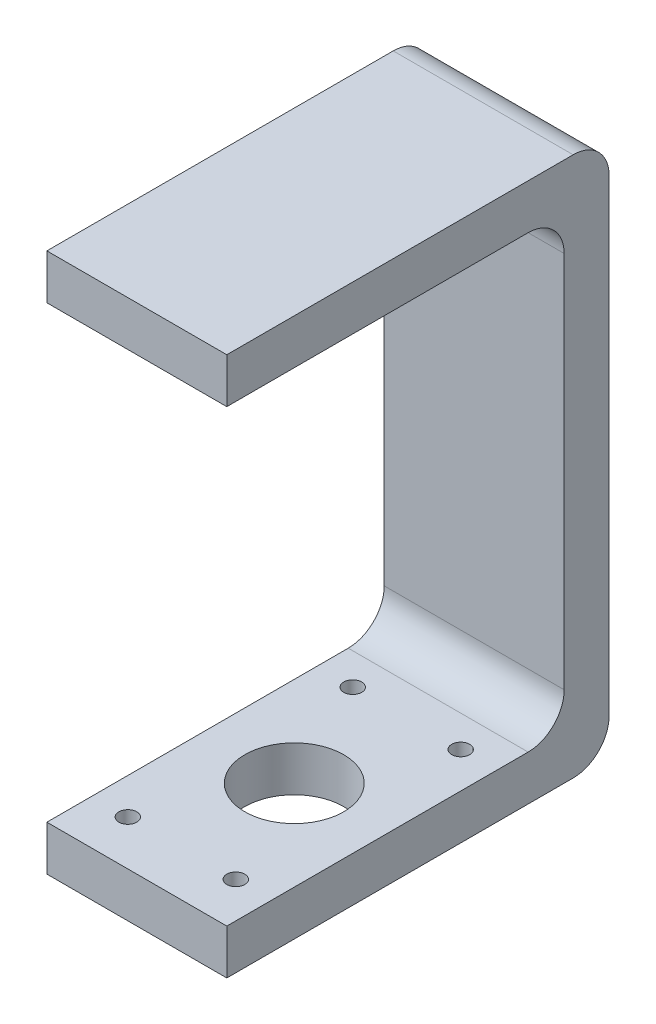
ISO-10303-21;
HEADER;
FILE_DESCRIPTION(('STEP AP214'),'2;1');
FILE_NAME('part.step','',(''),(''),'','','');
FILE_SCHEMA(('AUTOMOTIVE_DESIGN { 1 0 10303 214 1 1 1 1 }'));
ENDSEC;
DATA;
#1=APPLICATION_CONTEXT('core data for automotive mechanical design processes');
#2=APPLICATION_PROTOCOL_DEFINITION('international standard','automotive_design',2000,#1);
#3=PRODUCT_CONTEXT('',#1,'mechanical');
#4=PRODUCT('Part','Part','',(#3));
#5=PRODUCT_RELATED_PRODUCT_CATEGORY('part','',(#4));
#6=PRODUCT_DEFINITION_FORMATION('','',#4);
#7=PRODUCT_DEFINITION_CONTEXT('part definition',#1,'design');
#8=PRODUCT_DEFINITION('design','',#6,#7);
#9=PRODUCT_DEFINITION_SHAPE('','',#8);
#10=(LENGTH_UNIT() NAMED_UNIT(*) SI_UNIT(.MILLI.,.METRE.));
#11=(NAMED_UNIT(*) PLANE_ANGLE_UNIT() SI_UNIT($,.RADIAN.));
#12=(NAMED_UNIT(*) SI_UNIT($,.STERADIAN.) SOLID_ANGLE_UNIT());
#13=UNCERTAINTY_MEASURE_WITH_UNIT(LENGTH_MEASURE(1.E-05),#10,'distance_accuracy_value','');
#14=(GEOMETRIC_REPRESENTATION_CONTEXT(3) GLOBAL_UNCERTAINTY_ASSIGNED_CONTEXT((#13)) GLOBAL_UNIT_ASSIGNED_CONTEXT((#10,
#11,#12)) REPRESENTATION_CONTEXT('',''));
#15=CARTESIAN_POINT('',(0.,0.,0.));
#16=DIRECTION('',(0.,0.,1.));
#17=DIRECTION('',(1.,0.,0.));
#18=AXIS2_PLACEMENT_3D('',#15,#16,#17);
#19=CARTESIAN_POINT('',(40.,10.,0.));
#20=DIRECTION('',(0.,0.,-1.));
#21=DIRECTION('',(0.,1.,0.));
#22=AXIS2_PLACEMENT_3D('',#19,#20,#21);
#23=PLANE('',#22);
#24=DIRECTION('',(0.,-1.,0.));
#25=VECTOR('',#24,1.);
#26=CARTESIAN_POINT('',(0.,10.,0.));
#27=LINE('',#26,#25);
#28=CARTESIAN_POINT('',(0.,10.,0.));
#29=VERTEX_POINT('',#28);
#30=CARTESIAN_POINT('',(0.,0.,0.));
#31=VERTEX_POINT('',#30);
#32=EDGE_CURVE('E157',#29,#31,#27,.T.);
#33=ORIENTED_EDGE('',*,*,#32,.T.);
#34=DIRECTION('',(-1.,0.,0.));
#35=VECTOR('',#34,1.);
#36=CARTESIAN_POINT('',(40.,0.,0.));
#37=LINE('',#36,#35);
#38=CARTESIAN_POINT('',(40.,0.,0.));
#39=VERTEX_POINT('',#38);
#40=EDGE_CURVE('E11',#39,#31,#37,.T.);
#41=ORIENTED_EDGE('',*,*,#40,.F.);
#42=DIRECTION('',(0.,-1.,0.));
#43=VECTOR('',#42,1.);
#44=CARTESIAN_POINT('',(40.,10.,0.));
#45=LINE('',#44,#43);
#46=CARTESIAN_POINT('',(40.,10.,0.));
#47=VERTEX_POINT('',#46);
#48=EDGE_CURVE('E180',#47,#39,#45,.T.);
#49=ORIENTED_EDGE('',*,*,#48,.F.);
#50=DIRECTION('',(-1.,0.,0.));
#51=VECTOR('',#50,1.);
#52=CARTESIAN_POINT('',(40.,10.,0.));
#53=LINE('',#52,#51);
#54=EDGE_CURVE('E153',#47,#29,#53,.T.);
#55=ORIENTED_EDGE('',*,*,#54,.T.);
#56=EDGE_LOOP('',(#33,#41,#49,#55));
#57=FACE_BOUND('',#56,.T.);
#58=ADVANCED_FACE('F35',(#57),#23,.F.);
#59=CARTESIAN_POINT('',(40.,0.,0.));
#60=DIRECTION('',(0.,1.,0.));
#61=DIRECTION('',(0.,0.,1.));
#62=AXIS2_PLACEMENT_3D('',#59,#60,#61);
#63=PLANE('',#62);
#64=CARTESIAN_POINT('',(31.9999999999999,0.,-10.0000000000004));
#65=DIRECTION('',(0.,-1.,0.));
#66=DIRECTION('',(0.,0.,-1.));
#67=AXIS2_PLACEMENT_3D('',#64,#65,#66);
#68=CIRCLE('',#67,2.);
#69=CARTESIAN_POINT('',(31.9999999999999,0.,-12.0000000000003));
#70=VERTEX_POINT('',#69);
#71=EDGE_CURVE('E212',#70,#70,#68,.T.);
#72=ORIENTED_EDGE('',*,*,#71,.F.);
#73=EDGE_LOOP('',(#72));
#74=FACE_BOUND('',#73,.T.);
#75=CARTESIAN_POINT('',(7.99999999999992,0.,-60.0000000000004));
#76=DIRECTION('',(0.,-1.,0.));
#77=DIRECTION('',(0.,0.,-1.));
#78=AXIS2_PLACEMENT_3D('',#75,#76,#77);
#79=CIRCLE('',#78,2.);
#80=CARTESIAN_POINT('',(7.99999999999992,0.,-62.0000000000004));
#81=VERTEX_POINT('',#80);
#82=EDGE_CURVE('E385',#81,#81,#79,.T.);
#83=ORIENTED_EDGE('',*,*,#82,.F.);
#84=EDGE_LOOP('',(#83));
#85=FACE_BOUND('',#84,.T.);
#86=CARTESIAN_POINT('',(31.9999999999999,0.,-60.0000000000004));
#87=DIRECTION('',(0.,-1.,0.));
#88=DIRECTION('',(0.,0.,-1.));
#89=AXIS2_PLACEMENT_3D('',#86,#87,#88);
#90=CIRCLE('',#89,2.);
#91=CARTESIAN_POINT('',(31.9999999999999,0.,-62.0000000000004));
#92=VERTEX_POINT('',#91);
#93=EDGE_CURVE('E225',#92,#92,#90,.T.);
#94=ORIENTED_EDGE('',*,*,#93,.F.);
#95=EDGE_LOOP('',(#94));
#96=FACE_BOUND('',#95,.T.);
#97=CARTESIAN_POINT('',(7.99999999999992,0.,-10.0000000000004));
#98=DIRECTION('',(0.,-1.,0.));
#99=DIRECTION('',(0.,0.,-1.));
#100=AXIS2_PLACEMENT_3D('',#97,#98,#99);
#101=CIRCLE('',#100,2.);
#102=CARTESIAN_POINT('',(7.99999999999992,0.,-12.0000000000004));
#103=VERTEX_POINT('',#102);
#104=EDGE_CURVE('E208',#103,#103,#101,.T.);
#105=ORIENTED_EDGE('',*,*,#104,.F.);
#106=EDGE_LOOP('',(#105));
#107=FACE_BOUND('',#106,.T.);
#108=CARTESIAN_POINT('',(20.,0.,-35.));
#109=DIRECTION('',(0.,-1.,0.));
#110=DIRECTION('',(0.,0.,-1.));
#111=AXIS2_PLACEMENT_3D('',#108,#109,#110);
#112=CIRCLE('',#111,11.);
#113=CARTESIAN_POINT('',(20.,0.,-46.));
#114=VERTEX_POINT('',#113);
#115=EDGE_CURVE('E161',#114,#114,#112,.T.);
#116=ORIENTED_EDGE('',*,*,#115,.F.);
#117=EDGE_LOOP('',(#116));
#118=FACE_BOUND('',#117,.T.);
#119=DIRECTION('',(0.,0.,-1.));
#120=VECTOR('',#119,1.);
#121=CARTESIAN_POINT('',(0.,0.,0.));
#122=LINE('',#121,#120);
#123=CARTESIAN_POINT('',(0.,0.,-77.));
#124=VERTEX_POINT('',#123);
#125=EDGE_CURVE('E160',#31,#124,#122,.T.);
#126=ORIENTED_EDGE('',*,*,#125,.T.);
#127=DIRECTION('',(-1.,0.,0.));
#128=VECTOR('',#127,1.);
#129=CARTESIAN_POINT('',(40.,0.,-77.));
#130=LINE('',#129,#128);
#131=CARTESIAN_POINT('',(40.,0.,-77.));
#132=VERTEX_POINT('',#131);
#133=EDGE_CURVE('E44',#132,#124,#130,.T.);
#134=ORIENTED_EDGE('',*,*,#133,.F.);
#135=DIRECTION('',(0.,0.,-1.));
#136=VECTOR('',#135,1.);
#137=CARTESIAN_POINT('',(40.,0.,0.));
#138=LINE('',#137,#136);
#139=EDGE_CURVE('E108',#39,#132,#138,.T.);
#140=ORIENTED_EDGE('',*,*,#139,.F.);
#141=ORIENTED_EDGE('',*,*,#40,.T.);
#142=EDGE_LOOP('',(#126,#134,#140,#141));
#143=FACE_BOUND('',#142,.T.);
#144=ADVANCED_FACE('F274',(#74,#85,#96,#107,#118,#143),#63,.F.);
#145=CARTESIAN_POINT('',(40.,8.,-77.));
#146=DIRECTION('',(-1.,0.,0.));
#147=DIRECTION('',(0.,0.,1.));
#148=AXIS2_PLACEMENT_3D('',#145,#146,#147);
#149=CYLINDRICAL_SURFACE('',#148,8.);
#150=CARTESIAN_POINT('',(0.,8.,-77.));
#151=DIRECTION('',(1.,0.,0.));
#152=DIRECTION('',(0.,0.,1.));
#153=AXIS2_PLACEMENT_3D('',#150,#151,#152);
#154=CIRCLE('',#153,8.);
#155=CARTESIAN_POINT('',(0.,8.,-85.));
#156=VERTEX_POINT('',#155);
#157=EDGE_CURVE('E163',#124,#156,#154,.T.);
#158=ORIENTED_EDGE('',*,*,#157,.T.);
#159=DIRECTION('',(-1.,0.,0.));
#160=VECTOR('',#159,1.);
#161=CARTESIAN_POINT('',(40.,8.,-85.));
#162=LINE('',#161,#160);
#163=CARTESIAN_POINT('',(40.,8.,-85.));
#164=VERTEX_POINT('',#163);
#165=EDGE_CURVE('E199',#164,#156,#162,.T.);
#166=ORIENTED_EDGE('',*,*,#165,.F.);
#167=CARTESIAN_POINT('',(40.,8.,-77.));
#168=DIRECTION('',(1.,0.,0.));
#169=DIRECTION('',(0.,0.,1.));
#170=AXIS2_PLACEMENT_3D('',#167,#168,#169);
#171=CIRCLE('',#170,8.);
#172=EDGE_CURVE('E233',#132,#164,#171,.T.);
#173=ORIENTED_EDGE('',*,*,#172,.F.);
#174=ORIENTED_EDGE('',*,*,#133,.T.);
#175=EDGE_LOOP('',(#158,#166,#173,#174));
#176=FACE_BOUND('',#175,.T.);
#177=ADVANCED_FACE('F278',(#176),#149,.T.);
#178=CARTESIAN_POINT('',(40.,8.,-85.));
#179=DIRECTION('',(0.,0.,1.));
#180=DIRECTION('',(1.,0.,0.));
#181=AXIS2_PLACEMENT_3D('',#178,#179,#180);
#182=PLANE('',#181);
#183=DIRECTION('',(0.,1.,0.));
#184=VECTOR('',#183,1.);
#185=CARTESIAN_POINT('',(0.,8.,-85.));
#186=LINE('',#185,#184);
#187=CARTESIAN_POINT('',(0.,112.,-85.));
#188=VERTEX_POINT('',#187);
#189=EDGE_CURVE('E165',#156,#188,#186,.T.);
#190=ORIENTED_EDGE('',*,*,#189,.T.);
#191=DIRECTION('',(-1.,0.,0.));
#192=VECTOR('',#191,1.);
#193=CARTESIAN_POINT('',(40.,112.,-85.));
#194=LINE('',#193,#192);
#195=CARTESIAN_POINT('',(40.,112.,-85.));
#196=VERTEX_POINT('',#195);
#197=EDGE_CURVE('E196',#196,#188,#194,.T.);
#198=ORIENTED_EDGE('',*,*,#197,.F.);
#199=DIRECTION('',(0.,1.,0.));
#200=VECTOR('',#199,1.);
#201=CARTESIAN_POINT('',(40.,8.,-85.));
#202=LINE('',#201,#200);
#203=EDGE_CURVE('E235',#164,#196,#202,.T.);
#204=ORIENTED_EDGE('',*,*,#203,.F.);
#205=ORIENTED_EDGE('',*,*,#165,.T.);
#206=EDGE_LOOP('',(#190,#198,#204,#205));
#207=FACE_BOUND('',#206,.T.);
#208=ADVANCED_FACE('F283',(#207),#182,.F.);
#209=CARTESIAN_POINT('',(40.,112.,-77.));
#210=DIRECTION('',(-1.,0.,0.));
#211=DIRECTION('',(0.,0.,1.));
#212=AXIS2_PLACEMENT_3D('',#209,#210,#211);
#213=CYLINDRICAL_SURFACE('',#212,8.);
#214=CARTESIAN_POINT('',(0.,112.,-77.));
#215=DIRECTION('',(1.,0.,0.));
#216=DIRECTION('',(0.,0.,-1.));
#217=AXIS2_PLACEMENT_3D('',#214,#215,#216);
#218=CIRCLE('',#217,8.);
#219=CARTESIAN_POINT('',(0.,120.,-77.));
#220=VERTEX_POINT('',#219);
#221=EDGE_CURVE('E167',#188,#220,#218,.T.);
#222=ORIENTED_EDGE('',*,*,#221,.T.);
#223=DIRECTION('',(-1.,0.,0.));
#224=VECTOR('',#223,1.);
#225=CARTESIAN_POINT('',(40.,120.,-77.));
#226=LINE('',#225,#224);
#227=CARTESIAN_POINT('',(40.,120.,-77.));
#228=VERTEX_POINT('',#227);
#229=EDGE_CURVE('E193',#228,#220,#226,.T.);
#230=ORIENTED_EDGE('',*,*,#229,.F.);
#231=CARTESIAN_POINT('',(40.,112.,-77.));
#232=DIRECTION('',(1.,0.,0.));
#233=DIRECTION('',(0.,0.,-1.));
#234=AXIS2_PLACEMENT_3D('',#231,#232,#233);
#235=CIRCLE('',#234,8.);
#236=EDGE_CURVE('E237',#196,#228,#235,.T.);
#237=ORIENTED_EDGE('',*,*,#236,.F.);
#238=ORIENTED_EDGE('',*,*,#197,.T.);
#239=EDGE_LOOP('',(#222,#230,#237,#238));
#240=FACE_BOUND('',#239,.T.);
#241=ADVANCED_FACE('F291',(#240),#213,.T.);
#242=CARTESIAN_POINT('',(40.,120.,-77.));
#243=DIRECTION('',(0.,-1.,0.));
#244=DIRECTION('',(0.,0.,-1.));
#245=AXIS2_PLACEMENT_3D('',#242,#243,#244);
#246=PLANE('',#245);
#247=DIRECTION('',(0.,0.,1.));
#248=VECTOR('',#247,1.);
#249=CARTESIAN_POINT('',(0.,120.,-77.));
#250=LINE('',#249,#248);
#251=CARTESIAN_POINT('',(0.,120.,0.));
#252=VERTEX_POINT('',#251);
#253=EDGE_CURVE('E169',#220,#252,#250,.T.);
#254=ORIENTED_EDGE('',*,*,#253,.T.);
#255=DIRECTION('',(-1.,0.,0.));
#256=VECTOR('',#255,1.);
#257=CARTESIAN_POINT('',(40.,120.,0.));
#258=LINE('',#257,#256);
#259=CARTESIAN_POINT('',(40.,120.,0.));
#260=VERTEX_POINT('',#259);
#261=EDGE_CURVE('E190',#260,#252,#258,.T.);
#262=ORIENTED_EDGE('',*,*,#261,.F.);
#263=DIRECTION('',(0.,0.,1.));
#264=VECTOR('',#263,1.);
#265=CARTESIAN_POINT('',(40.,120.,-77.));
#266=LINE('',#265,#264);
#267=EDGE_CURVE('E239',#228,#260,#266,.T.);
#268=ORIENTED_EDGE('',*,*,#267,.F.);
#269=ORIENTED_EDGE('',*,*,#229,.T.);
#270=EDGE_LOOP('',(#254,#262,#268,#269));
#271=FACE_BOUND('',#270,.T.);
#272=ADVANCED_FACE('F295',(#271),#246,.F.);
#273=CARTESIAN_POINT('',(40.,120.,0.));
#274=DIRECTION('',(0.,0.,-1.));
#275=DIRECTION('',(0.,1.,0.));
#276=AXIS2_PLACEMENT_3D('',#273,#274,#275);
#277=PLANE('',#276);
#278=DIRECTION('',(0.,-1.,0.));
#279=VECTOR('',#278,1.);
#280=CARTESIAN_POINT('',(0.,120.,0.));
#281=LINE('',#280,#279);
#282=CARTESIAN_POINT('',(0.,110.,0.));
#283=VERTEX_POINT('',#282);
#284=EDGE_CURVE('E171',#252,#283,#281,.T.);
#285=ORIENTED_EDGE('',*,*,#284,.T.);
#286=DIRECTION('',(-1.,0.,0.));
#287=VECTOR('',#286,1.);
#288=CARTESIAN_POINT('',(40.,110.,0.));
#289=LINE('',#288,#287);
#290=CARTESIAN_POINT('',(40.,110.,0.));
#291=VERTEX_POINT('',#290);
#292=EDGE_CURVE('E187',#291,#283,#289,.T.);
#293=ORIENTED_EDGE('',*,*,#292,.F.);
#294=DIRECTION('',(0.,-1.,0.));
#295=VECTOR('',#294,1.);
#296=CARTESIAN_POINT('',(40.,120.,0.));
#297=LINE('',#296,#295);
#298=EDGE_CURVE('E241',#260,#291,#297,.T.);
#299=ORIENTED_EDGE('',*,*,#298,.F.);
#300=ORIENTED_EDGE('',*,*,#261,.T.);
#301=EDGE_LOOP('',(#285,#293,#299,#300));
#302=FACE_BOUND('',#301,.T.);
#303=ADVANCED_FACE('F299',(#302),#277,.F.);
#304=CARTESIAN_POINT('',(40.,110.,0.));
#305=DIRECTION('',(0.,1.,0.));
#306=DIRECTION('',(0.,0.,1.));
#307=AXIS2_PLACEMENT_3D('',#304,#305,#306);
#308=PLANE('',#307);
#309=DIRECTION('',(0.,0.,-1.));
#310=VECTOR('',#309,1.);
#311=CARTESIAN_POINT('',(0.,110.,0.));
#312=LINE('',#311,#310);
#313=CARTESIAN_POINT('',(0.,110.,-67.));
#314=VERTEX_POINT('',#313);
#315=EDGE_CURVE('E173',#283,#314,#312,.T.);
#316=ORIENTED_EDGE('',*,*,#315,.T.);
#317=DIRECTION('',(-1.,0.,0.));
#318=VECTOR('',#317,1.);
#319=CARTESIAN_POINT('',(40.,110.,-67.));
#320=LINE('',#319,#318);
#321=CARTESIAN_POINT('',(40.,110.,-67.));
#322=VERTEX_POINT('',#321);
#323=EDGE_CURVE('E184',#322,#314,#320,.T.);
#324=ORIENTED_EDGE('',*,*,#323,.F.);
#325=DIRECTION('',(0.,0.,-1.));
#326=VECTOR('',#325,1.);
#327=CARTESIAN_POINT('',(40.,110.,0.));
#328=LINE('',#327,#326);
#329=EDGE_CURVE('E243',#291,#322,#328,.T.);
#330=ORIENTED_EDGE('',*,*,#329,.F.);
#331=ORIENTED_EDGE('',*,*,#292,.T.);
#332=EDGE_LOOP('',(#316,#324,#330,#331));
#333=FACE_BOUND('',#332,.T.);
#334=ADVANCED_FACE('F249',(#333),#308,.F.);
#335=CARTESIAN_POINT('',(40.,102.,-67.));
#336=DIRECTION('',(-1.,0.,0.));
#337=DIRECTION('',(0.,0.,1.));
#338=AXIS2_PLACEMENT_3D('',#335,#336,#337);
#339=CYLINDRICAL_SURFACE('',#338,8.00000000000001);
#340=CARTESIAN_POINT('',(0.,102.,-67.));
#341=DIRECTION('',(-1.,0.,0.));
#342=DIRECTION('',(0.,0.,-1.));
#343=AXIS2_PLACEMENT_3D('',#340,#341,#342);
#344=CIRCLE('',#343,8.00000000000001);
#345=CARTESIAN_POINT('',(0.,102.,-75.));
#346=VERTEX_POINT('',#345);
#347=EDGE_CURVE('E175',#314,#346,#344,.T.);
#348=ORIENTED_EDGE('',*,*,#347,.T.);
#349=DIRECTION('',(-1.,0.,0.));
#350=VECTOR('',#349,1.);
#351=CARTESIAN_POINT('',(40.,102.,-75.));
#352=LINE('',#351,#350);
#353=CARTESIAN_POINT('',(40.,102.,-75.));
#354=VERTEX_POINT('',#353);
#355=EDGE_CURVE('E148',#354,#346,#352,.T.);
#356=ORIENTED_EDGE('',*,*,#355,.F.);
#357=CARTESIAN_POINT('',(40.,102.,-67.));
#358=DIRECTION('',(-1.,0.,0.));
#359=DIRECTION('',(0.,0.,-1.));
#360=AXIS2_PLACEMENT_3D('',#357,#358,#359);
#361=CIRCLE('',#360,8.00000000000001);
#362=EDGE_CURVE('E139',#322,#354,#361,.T.);
#363=ORIENTED_EDGE('',*,*,#362,.F.);
#364=ORIENTED_EDGE('',*,*,#323,.T.);
#365=EDGE_LOOP('',(#348,#356,#363,#364));
#366=FACE_BOUND('',#365,.T.);
#367=ADVANCED_FACE('F253',(#366),#339,.F.);
#368=CARTESIAN_POINT('',(40.,102.,-75.));
#369=DIRECTION('',(0.,0.,-1.));
#370=DIRECTION('',(0.,1.,0.));
#371=AXIS2_PLACEMENT_3D('',#368,#369,#370);
#372=PLANE('',#371);
#373=DIRECTION('',(0.,-1.,0.));
#374=VECTOR('',#373,1.);
#375=CARTESIAN_POINT('',(0.,102.,-75.));
#376=LINE('',#375,#374);
#377=CARTESIAN_POINT('',(0.,18.,-75.));
#378=VERTEX_POINT('',#377);
#379=EDGE_CURVE('E147',#346,#378,#376,.T.);
#380=ORIENTED_EDGE('',*,*,#379,.T.);
#381=DIRECTION('',(-1.,0.,0.));
#382=VECTOR('',#381,1.);
#383=CARTESIAN_POINT('',(40.,18.,-75.));
#384=LINE('',#383,#382);
#385=CARTESIAN_POINT('',(40.,18.,-75.));
#386=VERTEX_POINT('',#385);
#387=EDGE_CURVE('E144',#386,#378,#384,.T.);
#388=ORIENTED_EDGE('',*,*,#387,.F.);
#389=DIRECTION('',(0.,-1.,0.));
#390=VECTOR('',#389,1.);
#391=CARTESIAN_POINT('',(40.,102.,-75.));
#392=LINE('',#391,#390);
#393=EDGE_CURVE('E133',#354,#386,#392,.T.);
#394=ORIENTED_EDGE('',*,*,#393,.F.);
#395=ORIENTED_EDGE('',*,*,#355,.T.);
#396=EDGE_LOOP('',(#380,#388,#394,#395));
#397=FACE_BOUND('',#396,.T.);
#398=ADVANCED_FACE('F145',(#397),#372,.F.);
#399=CARTESIAN_POINT('',(40.,18.,-67.));
#400=DIRECTION('',(-1.,0.,0.));
#401=DIRECTION('',(0.,0.,1.));
#402=AXIS2_PLACEMENT_3D('',#399,#400,#401);
#403=CYLINDRICAL_SURFACE('',#402,8.);
#404=CARTESIAN_POINT('',(0.,18.,-67.));
#405=DIRECTION('',(-1.,0.,0.));
#406=DIRECTION('',(0.,0.,-1.));
#407=AXIS2_PLACEMENT_3D('',#404,#405,#406);
#408=CIRCLE('',#407,8.);
#409=CARTESIAN_POINT('',(0.,10.,-67.));
#410=VERTEX_POINT('',#409);
#411=EDGE_CURVE('E94',#378,#410,#408,.T.);
#412=ORIENTED_EDGE('',*,*,#411,.T.);
#413=DIRECTION('',(-1.,0.,0.));
#414=VECTOR('',#413,1.);
#415=CARTESIAN_POINT('',(40.,10.,-67.));
#416=LINE('',#415,#414);
#417=CARTESIAN_POINT('',(40.,10.,-67.));
#418=VERTEX_POINT('',#417);
#419=EDGE_CURVE('E149',#418,#410,#416,.T.);
#420=ORIENTED_EDGE('',*,*,#419,.F.);
#421=CARTESIAN_POINT('',(40.,18.,-67.));
#422=DIRECTION('',(-1.,0.,0.));
#423=DIRECTION('',(0.,0.,-1.));
#424=AXIS2_PLACEMENT_3D('',#421,#422,#423);
#425=CIRCLE('',#424,8.);
#426=EDGE_CURVE('E137',#386,#418,#425,.T.);
#427=ORIENTED_EDGE('',*,*,#426,.F.);
#428=ORIENTED_EDGE('',*,*,#387,.T.);
#429=EDGE_LOOP('',(#412,#420,#427,#428));
#430=FACE_BOUND('',#429,.T.);
#431=ADVANCED_FACE('F151',(#430),#403,.F.);
#432=CARTESIAN_POINT('',(40.,10.,-67.));
#433=DIRECTION('',(0.,-1.,0.));
#434=DIRECTION('',(0.,0.,-1.));
#435=AXIS2_PLACEMENT_3D('',#432,#433,#434);
#436=PLANE('',#435);
#437=CARTESIAN_POINT('',(31.9999999999999,10.,-10.0000000000004));
#438=DIRECTION('',(0.,-1.,0.));
#439=DIRECTION('',(0.,0.,-1.));
#440=AXIS2_PLACEMENT_3D('',#437,#438,#439);
#441=CIRCLE('',#440,2.);
#442=CARTESIAN_POINT('',(31.9999999999999,10.,-12.0000000000003));
#443=VERTEX_POINT('',#442);
#444=EDGE_CURVE('E38',#443,#443,#441,.T.);
#445=ORIENTED_EDGE('',*,*,#444,.T.);
#446=EDGE_LOOP('',(#445));
#447=FACE_BOUND('',#446,.T.);
#448=CARTESIAN_POINT('',(7.99999999999992,10.,-60.0000000000004));
#449=DIRECTION('',(0.,-1.,0.));
#450=DIRECTION('',(0.,0.,-1.));
#451=AXIS2_PLACEMENT_3D('',#448,#449,#450);
#452=CIRCLE('',#451,2.);
#453=CARTESIAN_POINT('',(7.99999999999992,10.,-62.0000000000004));
#454=VERTEX_POINT('',#453);
#455=EDGE_CURVE('E211',#454,#454,#452,.T.);
#456=ORIENTED_EDGE('',*,*,#455,.T.);
#457=EDGE_LOOP('',(#456));
#458=FACE_BOUND('',#457,.T.);
#459=CARTESIAN_POINT('',(31.9999999999999,10.,-60.0000000000004));
#460=DIRECTION('',(0.,-1.,0.));
#461=DIRECTION('',(0.,0.,-1.));
#462=AXIS2_PLACEMENT_3D('',#459,#460,#461);
#463=CIRCLE('',#462,2.);
#464=CARTESIAN_POINT('',(31.9999999999999,10.,-62.0000000000004));
#465=VERTEX_POINT('',#464);
#466=EDGE_CURVE('E209',#465,#465,#463,.T.);
#467=ORIENTED_EDGE('',*,*,#466,.T.);
#468=EDGE_LOOP('',(#467));
#469=FACE_BOUND('',#468,.T.);
#470=CARTESIAN_POINT('',(7.99999999999992,10.,-10.0000000000004));
#471=DIRECTION('',(0.,-1.,0.));
#472=DIRECTION('',(0.,0.,-1.));
#473=AXIS2_PLACEMENT_3D('',#470,#471,#472);
#474=CIRCLE('',#473,2.);
#475=CARTESIAN_POINT('',(7.99999999999992,10.,-12.0000000000004));
#476=VERTEX_POINT('',#475);
#477=EDGE_CURVE('E204',#476,#476,#474,.T.);
#478=ORIENTED_EDGE('',*,*,#477,.T.);
#479=EDGE_LOOP('',(#478));
#480=FACE_BOUND('',#479,.T.);
#481=CARTESIAN_POINT('',(20.,10.,-35.));
#482=DIRECTION('',(0.,-1.,0.));
#483=DIRECTION('',(0.,0.,-1.));
#484=AXIS2_PLACEMENT_3D('',#481,#482,#483);
#485=CIRCLE('',#484,11.);
#486=CARTESIAN_POINT('',(20.,10.,-46.));
#487=VERTEX_POINT('',#486);
#488=EDGE_CURVE('E207',#487,#487,#485,.F.);
#489=ORIENTED_EDGE('',*,*,#488,.F.);
#490=EDGE_LOOP('',(#489));
#491=FACE_BOUND('',#490,.T.);
#492=DIRECTION('',(0.,0.,1.));
#493=VECTOR('',#492,1.);
#494=CARTESIAN_POINT('',(0.,10.,-67.));
#495=LINE('',#494,#493);
#496=EDGE_CURVE('E100',#410,#29,#495,.T.);
#497=ORIENTED_EDGE('',*,*,#496,.T.);
#498=ORIENTED_EDGE('',*,*,#54,.F.);
#499=DIRECTION('',(0.,0.,1.));
#500=VECTOR('',#499,1.);
#501=CARTESIAN_POINT('',(40.,10.,-67.));
#502=LINE('',#501,#500);
#503=EDGE_CURVE('E53',#418,#47,#502,.T.);
#504=ORIENTED_EDGE('',*,*,#503,.F.);
#505=ORIENTED_EDGE('',*,*,#419,.T.);
#506=EDGE_LOOP('',(#497,#498,#504,#505));
#507=FACE_BOUND('',#506,.T.);
#508=ADVANCED_FACE('F261',(#447,#458,#469,#480,#491,#507),#436,.F.);
#509=CARTESIAN_POINT('',(40.,8.,-77.));
#510=DIRECTION('',(-1.,0.,0.));
#511=DIRECTION('',(0.,0.,1.));
#512=AXIS2_PLACEMENT_3D('',#509,#510,#511);
#513=PLANE('',#512);
#514=ORIENTED_EDGE('',*,*,#48,.T.);
#515=ORIENTED_EDGE('',*,*,#139,.T.);
#516=ORIENTED_EDGE('',*,*,#172,.T.);
#517=ORIENTED_EDGE('',*,*,#203,.T.);
#518=ORIENTED_EDGE('',*,*,#236,.T.);
#519=ORIENTED_EDGE('',*,*,#267,.T.);
#520=ORIENTED_EDGE('',*,*,#298,.T.);
#521=ORIENTED_EDGE('',*,*,#329,.T.);
#522=ORIENTED_EDGE('',*,*,#362,.T.);
#523=ORIENTED_EDGE('',*,*,#393,.T.);
#524=ORIENTED_EDGE('',*,*,#426,.T.);
#525=ORIENTED_EDGE('',*,*,#503,.T.);
#526=EDGE_LOOP('',(#514,#515,#516,#517,#518,#519,#520,#521,#522,#523,#524,#525));
#527=FACE_BOUND('',#526,.T.);
#528=ADVANCED_FACE('F135',(#527),#513,.F.);
#529=CARTESIAN_POINT('',(0.,8.,-77.));
#530=DIRECTION('',(-1.,0.,0.));
#531=DIRECTION('',(0.,0.,1.));
#532=AXIS2_PLACEMENT_3D('',#529,#530,#531);
#533=PLANE('',#532);
#534=ORIENTED_EDGE('',*,*,#32,.F.);
#535=ORIENTED_EDGE('',*,*,#496,.F.);
#536=ORIENTED_EDGE('',*,*,#411,.F.);
#537=ORIENTED_EDGE('',*,*,#379,.F.);
#538=ORIENTED_EDGE('',*,*,#347,.F.);
#539=ORIENTED_EDGE('',*,*,#315,.F.);
#540=ORIENTED_EDGE('',*,*,#284,.F.);
#541=ORIENTED_EDGE('',*,*,#253,.F.);
#542=ORIENTED_EDGE('',*,*,#221,.F.);
#543=ORIENTED_EDGE('',*,*,#189,.F.);
#544=ORIENTED_EDGE('',*,*,#157,.F.);
#545=ORIENTED_EDGE('',*,*,#125,.F.);
#546=EDGE_LOOP('',(#534,#535,#536,#537,#538,#539,#540,#541,#542,#543,#544,#545));
#547=FACE_BOUND('',#546,.T.);
#548=ADVANCED_FACE('F256',(#547),#533,.T.);
#549=CARTESIAN_POINT('',(20.,120.001,-35.));
#550=DIRECTION('',(0.,-1.,0.));
#551=DIRECTION('',(0.,0.,-1.));
#552=AXIS2_PLACEMENT_3D('',#549,#550,#551);
#553=CYLINDRICAL_SURFACE('',#552,11.);
#554=ORIENTED_EDGE('',*,*,#115,.T.);
#555=EDGE_LOOP('',(#554));
#556=FACE_BOUND('',#555,.T.);
#557=ORIENTED_EDGE('',*,*,#488,.T.);
#558=EDGE_LOOP('',(#557));
#559=FACE_BOUND('',#558,.T.);
#560=ADVANCED_FACE('F331',(#556,#559),#553,.F.);
#561=CARTESIAN_POINT('',(7.99999999999992,20.,-10.0000000000004));
#562=DIRECTION('',(0.,-1.,0.));
#563=DIRECTION('',(0.,0.,-1.));
#564=AXIS2_PLACEMENT_3D('',#561,#562,#563);
#565=CYLINDRICAL_SURFACE('',#564,2.);
#566=ORIENTED_EDGE('',*,*,#104,.T.);
#567=EDGE_LOOP('',(#566));
#568=FACE_BOUND('',#567,.T.);
#569=ORIENTED_EDGE('',*,*,#477,.F.);
#570=EDGE_LOOP('',(#569));
#571=FACE_BOUND('',#570,.T.);
#572=ADVANCED_FACE('F336',(#568,#571),#565,.F.);
#573=CARTESIAN_POINT('',(31.9999999999999,20.,-60.0000000000004));
#574=DIRECTION('',(0.,-1.,0.));
#575=DIRECTION('',(0.,0.,-1.));
#576=AXIS2_PLACEMENT_3D('',#573,#574,#575);
#577=CYLINDRICAL_SURFACE('',#576,2.);
#578=ORIENTED_EDGE('',*,*,#93,.T.);
#579=EDGE_LOOP('',(#578));
#580=FACE_BOUND('',#579,.T.);
#581=ORIENTED_EDGE('',*,*,#466,.F.);
#582=EDGE_LOOP('',(#581));
#583=FACE_BOUND('',#582,.T.);
#584=ADVANCED_FACE('F343',(#580,#583),#577,.F.);
#585=CARTESIAN_POINT('',(7.99999999999992,20.,-60.0000000000004));
#586=DIRECTION('',(0.,-1.,0.));
#587=DIRECTION('',(0.,0.,-1.));
#588=AXIS2_PLACEMENT_3D('',#585,#586,#587);
#589=CYLINDRICAL_SURFACE('',#588,2.);
#590=ORIENTED_EDGE('',*,*,#82,.T.);
#591=EDGE_LOOP('',(#590));
#592=FACE_BOUND('',#591,.T.);
#593=ORIENTED_EDGE('',*,*,#455,.F.);
#594=EDGE_LOOP('',(#593));
#595=FACE_BOUND('',#594,.T.);
#596=ADVANCED_FACE('F350',(#592,#595),#589,.F.);
#597=CARTESIAN_POINT('',(31.9999999999999,20.,-10.0000000000004));
#598=DIRECTION('',(0.,-1.,0.));
#599=DIRECTION('',(0.,0.,-1.));
#600=AXIS2_PLACEMENT_3D('',#597,#598,#599);
#601=CYLINDRICAL_SURFACE('',#600,2.);
#602=ORIENTED_EDGE('',*,*,#71,.T.);
#603=EDGE_LOOP('',(#602));
#604=FACE_BOUND('',#603,.T.);
#605=ORIENTED_EDGE('',*,*,#444,.F.);
#606=EDGE_LOOP('',(#605));
#607=FACE_BOUND('',#606,.T.);
#608=ADVANCED_FACE('F358',(#604,#607),#601,.F.);
#609=CLOSED_SHELL('',(#58,#144,#177,#208,#241,#272,#303,#334,#367,#398,#431,#508,#528,#548,#560,
#572,#584,#596,#608));
#610=MANIFOLD_SOLID_BREP('B2',#609);
#611=ADVANCED_BREP_SHAPE_REPRESENTATION('',(#18,#610),#14);
#612=SHAPE_DEFINITION_REPRESENTATION(#9,#611);
ENDSEC;
END-ISO-10303-21;
